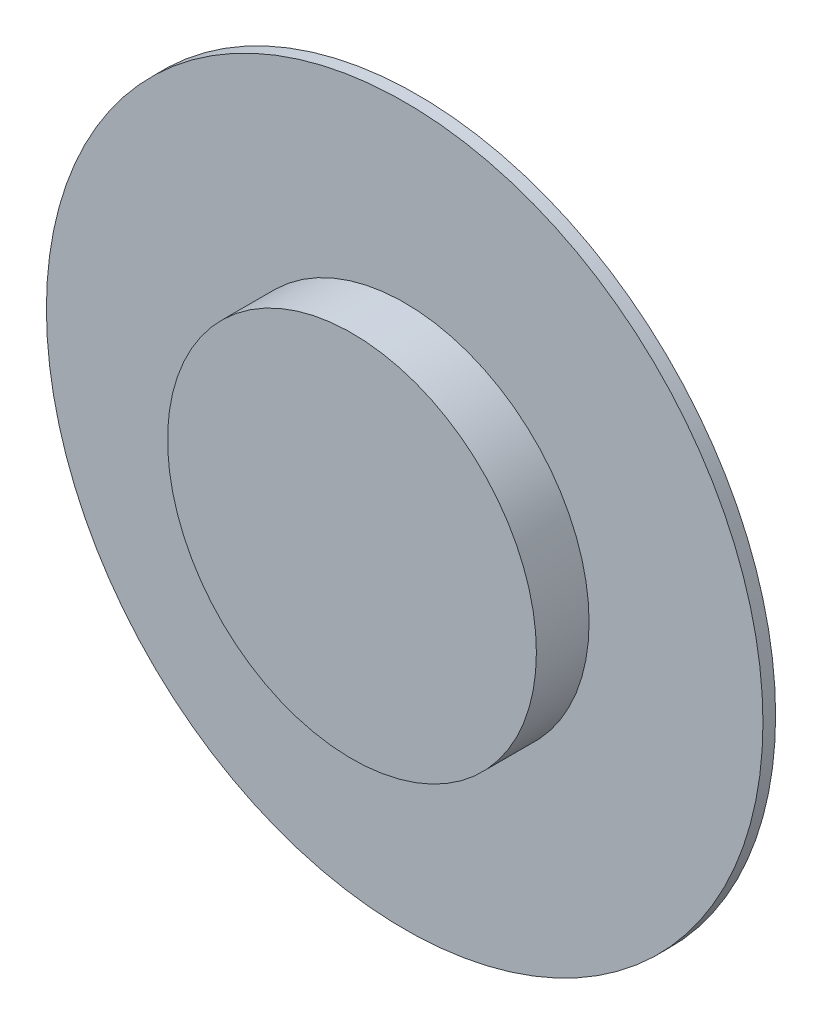
ISO-10303-21;
HEADER;
FILE_DESCRIPTION(('STEP AP214'),'2;1');
FILE_NAME('part.step','',(''),(''),'','','');
FILE_SCHEMA(('AUTOMOTIVE_DESIGN { 1 0 10303 214 1 1 1 1 }'));
ENDSEC;
DATA;
#1=APPLICATION_CONTEXT('core data for automotive mechanical design processes');
#2=APPLICATION_PROTOCOL_DEFINITION('international standard','automotive_design',2000,#1);
#3=PRODUCT_CONTEXT('',#1,'mechanical');
#4=PRODUCT('Part','Part','',(#3));
#5=PRODUCT_RELATED_PRODUCT_CATEGORY('part','',(#4));
#6=PRODUCT_DEFINITION_FORMATION('','',#4);
#7=PRODUCT_DEFINITION_CONTEXT('part definition',#1,'design');
#8=PRODUCT_DEFINITION('design','',#6,#7);
#9=PRODUCT_DEFINITION_SHAPE('','',#8);
#10=(LENGTH_UNIT() NAMED_UNIT(*) SI_UNIT(.MILLI.,.METRE.));
#11=(NAMED_UNIT(*) PLANE_ANGLE_UNIT() SI_UNIT($,.RADIAN.));
#12=(NAMED_UNIT(*) SI_UNIT($,.STERADIAN.) SOLID_ANGLE_UNIT());
#13=UNCERTAINTY_MEASURE_WITH_UNIT(LENGTH_MEASURE(1.E-05),#10,'distance_accuracy_value','');
#14=(GEOMETRIC_REPRESENTATION_CONTEXT(3) GLOBAL_UNCERTAINTY_ASSIGNED_CONTEXT((#13)) GLOBAL_UNIT_ASSIGNED_CONTEXT((#10,
#11,#12)) REPRESENTATION_CONTEXT('',''));
#15=CARTESIAN_POINT('',(0.,0.,0.));
#16=DIRECTION('',(0.,0.,1.));
#17=DIRECTION('',(1.,0.,0.));
#18=AXIS2_PLACEMENT_3D('',#15,#16,#17);
#19=CARTESIAN_POINT('',(0.,0.,1.2));
#20=DIRECTION('',(0.,0.,-1.));
#21=DIRECTION('',(-1.,0.,0.));
#22=AXIS2_PLACEMENT_3D('',#19,#20,#21);
#23=CYLINDRICAL_SURFACE('',#22,34.);
#24=CARTESIAN_POINT('',(0.,0.,1.2));
#25=DIRECTION('',(0.,0.,-1.));
#26=DIRECTION('',(1.,0.,0.));
#27=AXIS2_PLACEMENT_3D('',#24,#25,#26);
#28=CIRCLE('',#27,34.);
#29=CARTESIAN_POINT('',(34.,0.,1.2));
#30=VERTEX_POINT('',#29);
#31=EDGE_CURVE('E10',#30,#30,#28,.T.);
#32=ORIENTED_EDGE('',*,*,#31,.T.);
#33=EDGE_LOOP('',(#32));
#34=FACE_BOUND('',#33,.T.);
#35=CARTESIAN_POINT('',(0.,0.,0.));
#36=DIRECTION('',(0.,0.,-1.));
#37=DIRECTION('',(1.,0.,0.));
#38=AXIS2_PLACEMENT_3D('',#35,#36,#37);
#39=CIRCLE('',#38,34.);
#40=CARTESIAN_POINT('',(34.,0.,0.));
#41=VERTEX_POINT('',#40);
#42=EDGE_CURVE('E18',#41,#41,#39,.T.);
#43=ORIENTED_EDGE('',*,*,#42,.F.);
#44=EDGE_LOOP('',(#43));
#45=FACE_BOUND('',#44,.T.);
#46=ADVANCED_FACE('F15',(#34,#45),#23,.T.);
#47=CARTESIAN_POINT('',(0.,0.,1.2));
#48=DIRECTION('',(0.,0.,-1.));
#49=DIRECTION('',(-1.,0.,0.));
#50=AXIS2_PLACEMENT_3D('',#47,#48,#49);
#51=PLANE('',#50);
#52=CARTESIAN_POINT('',(0.,0.,1.2));
#53=DIRECTION('',(0.,0.,-1.));
#54=DIRECTION('',(1.,0.,0.));
#55=AXIS2_PLACEMENT_3D('',#52,#53,#54);
#56=CIRCLE('',#55,17.5);
#57=CARTESIAN_POINT('',(17.5,0.,1.2));
#58=VERTEX_POINT('',#57);
#59=EDGE_CURVE('E28',#58,#58,#56,.T.);
#60=ORIENTED_EDGE('',*,*,#59,.T.);
#61=EDGE_LOOP('',(#60));
#62=FACE_BOUND('',#61,.T.);
#63=ORIENTED_EDGE('',*,*,#31,.F.);
#64=EDGE_LOOP('',(#63));
#65=FACE_BOUND('',#64,.T.);
#66=ADVANCED_FACE('F48',(#62,#65),#51,.F.);
#67=CARTESIAN_POINT('',(0.,0.,0.));
#68=DIRECTION('',(0.,0.,-1.));
#69=DIRECTION('',(-1.,0.,0.));
#70=AXIS2_PLACEMENT_3D('',#67,#68,#69);
#71=PLANE('',#70);
#72=ORIENTED_EDGE('',*,*,#42,.T.);
#73=EDGE_LOOP('',(#72));
#74=FACE_BOUND('',#73,.T.);
#75=ADVANCED_FACE('F45',(#74),#71,.T.);
#76=CARTESIAN_POINT('',(0.,0.,6.2));
#77=DIRECTION('',(0.,0.,-1.));
#78=DIRECTION('',(-1.,0.,0.));
#79=AXIS2_PLACEMENT_3D('',#76,#77,#78);
#80=CYLINDRICAL_SURFACE('',#79,17.5);
#81=CARTESIAN_POINT('',(0.,0.,6.2));
#82=DIRECTION('',(0.,0.,-1.));
#83=DIRECTION('',(1.,0.,0.));
#84=AXIS2_PLACEMENT_3D('',#81,#82,#83);
#85=CIRCLE('',#84,17.5);
#86=CARTESIAN_POINT('',(17.5,0.,6.2));
#87=VERTEX_POINT('',#86);
#88=EDGE_CURVE('E26',#87,#87,#85,.T.);
#89=ORIENTED_EDGE('',*,*,#88,.T.);
#90=EDGE_LOOP('',(#89));
#91=FACE_BOUND('',#90,.T.);
#92=ORIENTED_EDGE('',*,*,#59,.F.);
#93=EDGE_LOOP('',(#92));
#94=FACE_BOUND('',#93,.T.);
#95=ADVANCED_FACE('F35',(#91,#94),#80,.T.);
#96=CARTESIAN_POINT('',(0.,0.,6.2));
#97=DIRECTION('',(0.,0.,-1.));
#98=DIRECTION('',(-1.,0.,0.));
#99=AXIS2_PLACEMENT_3D('',#96,#97,#98);
#100=PLANE('',#99);
#101=ORIENTED_EDGE('',*,*,#88,.F.);
#102=EDGE_LOOP('',(#101));
#103=FACE_BOUND('',#102,.T.);
#104=ADVANCED_FACE('F38',(#103),#100,.F.);
#105=CLOSED_SHELL('',(#46,#66,#75,#95,#104));
#106=MANIFOLD_SOLID_BREP('B1',#105);
#107=ADVANCED_BREP_SHAPE_REPRESENTATION('',(#18,#106),#14);
#108=SHAPE_DEFINITION_REPRESENTATION(#9,#107);
ENDSEC;
END-ISO-10303-21;
